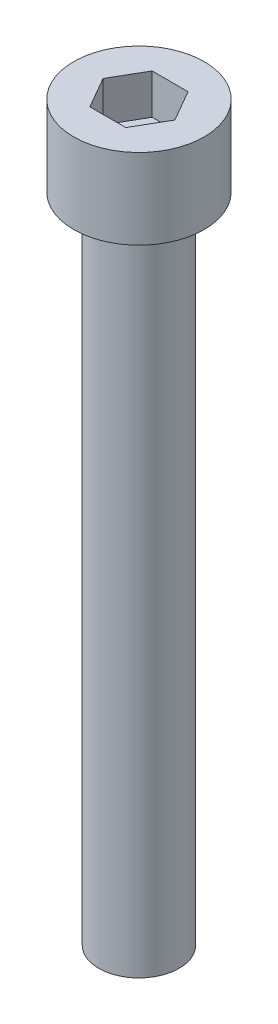
ISO-10303-21;
HEADER;
FILE_DESCRIPTION(('STEP AP214'),'2;1');
FILE_NAME('part.step','',(''),(''),'','','');
FILE_SCHEMA(('AUTOMOTIVE_DESIGN { 1 0 10303 214 1 1 1 1 }'));
ENDSEC;
DATA;
#1=APPLICATION_CONTEXT('core data for automotive mechanical design processes');
#2=APPLICATION_PROTOCOL_DEFINITION('international standard','automotive_design',2000,#1);
#3=PRODUCT_CONTEXT('',#1,'mechanical');
#4=PRODUCT('Part','Part','',(#3));
#5=PRODUCT_RELATED_PRODUCT_CATEGORY('part','',(#4));
#6=PRODUCT_DEFINITION_FORMATION('','',#4);
#7=PRODUCT_DEFINITION_CONTEXT('part definition',#1,'design');
#8=PRODUCT_DEFINITION('design','',#6,#7);
#9=PRODUCT_DEFINITION_SHAPE('','',#8);
#10=(LENGTH_UNIT() NAMED_UNIT(*) SI_UNIT(.MILLI.,.METRE.));
#11=(NAMED_UNIT(*) PLANE_ANGLE_UNIT() SI_UNIT($,.RADIAN.));
#12=(NAMED_UNIT(*) SI_UNIT($,.STERADIAN.) SOLID_ANGLE_UNIT());
#13=UNCERTAINTY_MEASURE_WITH_UNIT(LENGTH_MEASURE(1.E-05),#10,'distance_accuracy_value','');
#14=(GEOMETRIC_REPRESENTATION_CONTEXT(3) GLOBAL_UNCERTAINTY_ASSIGNED_CONTEXT((#13)) GLOBAL_UNIT_ASSIGNED_CONTEXT((#10,
#11,#12)) REPRESENTATION_CONTEXT('',''));
#15=CARTESIAN_POINT('',(0.,0.,0.));
#16=DIRECTION('',(0.,0.,1.));
#17=DIRECTION('',(1.,0.,0.));
#18=AXIS2_PLACEMENT_3D('',#15,#16,#17);
#19=CARTESIAN_POINT('',(0.,8.,0.));
#20=DIRECTION('',(0.,-1.,0.));
#21=DIRECTION('',(0.,0.,-1.));
#22=AXIS2_PLACEMENT_3D('',#19,#20,#21);
#23=CYLINDRICAL_SURFACE('',#22,6.5);
#24=CARTESIAN_POINT('',(0.,8.,0.));
#25=DIRECTION('',(0.,1.,0.));
#26=DIRECTION('',(0.,0.,1.));
#27=AXIS2_PLACEMENT_3D('',#24,#25,#26);
#28=CIRCLE('',#27,6.5);
#29=CARTESIAN_POINT('',(0.,8.,6.5));
#30=VERTEX_POINT('',#29);
#31=EDGE_CURVE('E45',#30,#30,#28,.T.);
#32=ORIENTED_EDGE('',*,*,#31,.F.);
#33=EDGE_LOOP('',(#32));
#34=FACE_BOUND('',#33,.T.);
#35=CARTESIAN_POINT('',(0.,0.,0.));
#36=DIRECTION('',(0.,1.,0.));
#37=DIRECTION('',(0.,0.,1.));
#38=AXIS2_PLACEMENT_3D('',#35,#36,#37);
#39=CIRCLE('',#38,6.5);
#40=CARTESIAN_POINT('',(0.,0.,6.5));
#41=VERTEX_POINT('',#40);
#42=EDGE_CURVE('E40',#41,#41,#39,.T.);
#43=ORIENTED_EDGE('',*,*,#42,.T.);
#44=EDGE_LOOP('',(#43));
#45=FACE_BOUND('',#44,.T.);
#46=ADVANCED_FACE('F37',(#34,#45),#23,.T.);
#47=CARTESIAN_POINT('',(0.,8.,0.));
#48=DIRECTION('',(0.,1.,0.));
#49=DIRECTION('',(0.,0.,1.));
#50=AXIS2_PLACEMENT_3D('',#47,#48,#49);
#51=PLANE('',#50);
#52=DIRECTION('',(0.5,0.,-0.866025403784439));
#53=VECTOR('',#52,1.);
#54=CARTESIAN_POINT('',(1.78978583448784,8.,3.1));
#55=LINE('',#54,#53);
#56=CARTESIAN_POINT('',(1.78978583448784,8.,3.1));
#57=VERTEX_POINT('',#56);
#58=CARTESIAN_POINT('',(3.57957166897568,8.,0.));
#59=VERTEX_POINT('',#58);
#60=EDGE_CURVE('E53',#57,#59,#55,.T.);
#61=ORIENTED_EDGE('',*,*,#60,.F.);
#62=DIRECTION('',(1.,0.,0.));
#63=VECTOR('',#62,1.);
#64=CARTESIAN_POINT('',(-1.78978583448784,8.,3.1));
#65=LINE('',#64,#63);
#66=CARTESIAN_POINT('',(-1.78978583448784,8.,3.1));
#67=VERTEX_POINT('',#66);
#68=EDGE_CURVE('E137',#67,#57,#65,.T.);
#69=ORIENTED_EDGE('',*,*,#68,.F.);
#70=DIRECTION('',(0.5,0.,0.866025403784439));
#71=VECTOR('',#70,1.);
#72=CARTESIAN_POINT('',(-3.57957166897568,8.,0.));
#73=LINE('',#72,#71);
#74=CARTESIAN_POINT('',(-3.57957166897568,8.,0.));
#75=VERTEX_POINT('',#74);
#76=EDGE_CURVE('E135',#75,#67,#73,.T.);
#77=ORIENTED_EDGE('',*,*,#76,.F.);
#78=DIRECTION('',(-0.5,0.,0.866025403784439));
#79=VECTOR('',#78,1.);
#80=CARTESIAN_POINT('',(-1.78978583448784,8.,-3.1));
#81=LINE('',#80,#79);
#82=CARTESIAN_POINT('',(-1.78978583448784,8.,-3.1));
#83=VERTEX_POINT('',#82);
#84=EDGE_CURVE('E101',#83,#75,#81,.T.);
#85=ORIENTED_EDGE('',*,*,#84,.F.);
#86=DIRECTION('',(-1.,0.,0.));
#87=VECTOR('',#86,1.);
#88=CARTESIAN_POINT('',(1.78978583448784,8.,-3.1));
#89=LINE('',#88,#87);
#90=CARTESIAN_POINT('',(1.78978583448784,8.,-3.1));
#91=VERTEX_POINT('',#90);
#92=EDGE_CURVE('E131',#91,#83,#89,.T.);
#93=ORIENTED_EDGE('',*,*,#92,.F.);
#94=DIRECTION('',(-0.5,0.,-0.866025403784439));
#95=VECTOR('',#94,1.);
#96=CARTESIAN_POINT('',(3.57957166897568,8.,0.));
#97=LINE('',#96,#95);
#98=EDGE_CURVE('E127',#59,#91,#97,.T.);
#99=ORIENTED_EDGE('',*,*,#98,.F.);
#100=EDGE_LOOP('',(#61,#69,#77,#85,#93,#99));
#101=FACE_BOUND('',#100,.T.);
#102=ORIENTED_EDGE('',*,*,#31,.T.);
#103=EDGE_LOOP('',(#102));
#104=FACE_BOUND('',#103,.T.);
#105=ADVANCED_FACE('F155',(#101,#104),#51,.T.);
#106=CARTESIAN_POINT('',(0.,0.,0.));
#107=DIRECTION('',(0.,1.,0.));
#108=DIRECTION('',(0.,0.,1.));
#109=AXIS2_PLACEMENT_3D('',#106,#107,#108);
#110=PLANE('',#109);
#111=CARTESIAN_POINT('',(0.,0.,0.));
#112=DIRECTION('',(0.,-1.,0.));
#113=DIRECTION('',(0.,0.,-1.));
#114=AXIS2_PLACEMENT_3D('',#111,#112,#113);
#115=CIRCLE('',#114,4.);
#116=CARTESIAN_POINT('',(0.,0.,-4.));
#117=VERTEX_POINT('',#116);
#118=EDGE_CURVE('E11',#117,#117,#115,.T.);
#119=ORIENTED_EDGE('',*,*,#118,.F.);
#120=EDGE_LOOP('',(#119));
#121=FACE_BOUND('',#120,.T.);
#122=ORIENTED_EDGE('',*,*,#42,.F.);
#123=EDGE_LOOP('',(#122));
#124=FACE_BOUND('',#123,.T.);
#125=ADVANCED_FACE('F152',(#121,#124),#110,.F.);
#126=CARTESIAN_POINT('',(1.78978583448784,4.,3.1));
#127=DIRECTION('',(0.866025403784439,0.,0.5));
#128=DIRECTION('',(0.5,0.,-0.866025403784439));
#129=AXIS2_PLACEMENT_3D('',#126,#127,#128);
#130=PLANE('',#129);
#131=ORIENTED_EDGE('',*,*,#60,.T.);
#132=DIRECTION('',(0.,1.,0.));
#133=VECTOR('',#132,1.);
#134=CARTESIAN_POINT('',(3.57957166897568,4.,0.));
#135=LINE('',#134,#133);
#136=CARTESIAN_POINT('',(3.57957166897568,4.,0.));
#137=VERTEX_POINT('',#136);
#138=EDGE_CURVE('E83',#137,#59,#135,.T.);
#139=ORIENTED_EDGE('',*,*,#138,.F.);
#140=DIRECTION('',(0.5,0.,-0.866025403784439));
#141=VECTOR('',#140,1.);
#142=CARTESIAN_POINT('',(1.78978583448784,4.,3.1));
#143=LINE('',#142,#141);
#144=CARTESIAN_POINT('',(1.78978583448784,4.,3.1));
#145=VERTEX_POINT('',#144);
#146=EDGE_CURVE('E139',#145,#137,#143,.T.);
#147=ORIENTED_EDGE('',*,*,#146,.F.);
#148=DIRECTION('',(0.,1.,0.));
#149=VECTOR('',#148,1.);
#150=CARTESIAN_POINT('',(1.78978583448784,4.,3.1));
#151=LINE('',#150,#149);
#152=EDGE_CURVE('E61',#145,#57,#151,.T.);
#153=ORIENTED_EDGE('',*,*,#152,.T.);
#154=EDGE_LOOP('',(#131,#139,#147,#153));
#155=FACE_BOUND('',#154,.T.);
#156=ADVANCED_FACE('F154',(#155),#130,.F.);
#157=CARTESIAN_POINT('',(-1.78978583448784,4.,3.1));
#158=DIRECTION('',(0.,0.,1.));
#159=DIRECTION('',(1.,0.,0.));
#160=AXIS2_PLACEMENT_3D('',#157,#158,#159);
#161=PLANE('',#160);
#162=ORIENTED_EDGE('',*,*,#68,.T.);
#163=ORIENTED_EDGE('',*,*,#152,.F.);
#164=DIRECTION('',(1.,0.,0.));
#165=VECTOR('',#164,1.);
#166=CARTESIAN_POINT('',(-1.78978583448784,4.,3.1));
#167=LINE('',#166,#165);
#168=CARTESIAN_POINT('',(-1.78978583448784,4.,3.1));
#169=VERTEX_POINT('',#168);
#170=EDGE_CURVE('E113',#169,#145,#167,.T.);
#171=ORIENTED_EDGE('',*,*,#170,.F.);
#172=DIRECTION('',(0.,1.,0.));
#173=VECTOR('',#172,1.);
#174=CARTESIAN_POINT('',(-1.78978583448784,4.,3.1));
#175=LINE('',#174,#173);
#176=EDGE_CURVE('E105',#169,#67,#175,.T.);
#177=ORIENTED_EDGE('',*,*,#176,.T.);
#178=EDGE_LOOP('',(#162,#163,#171,#177));
#179=FACE_BOUND('',#178,.T.);
#180=ADVANCED_FACE('F161',(#179),#161,.F.);
#181=CARTESIAN_POINT('',(-3.57957166897568,4.,0.));
#182=DIRECTION('',(-0.866025403784439,0.,0.5));
#183=DIRECTION('',(0.5,0.,0.866025403784439));
#184=AXIS2_PLACEMENT_3D('',#181,#182,#183);
#185=PLANE('',#184);
#186=ORIENTED_EDGE('',*,*,#76,.T.);
#187=ORIENTED_EDGE('',*,*,#176,.F.);
#188=DIRECTION('',(0.5,0.,0.866025403784439));
#189=VECTOR('',#188,1.);
#190=CARTESIAN_POINT('',(-3.57957166897568,4.,0.));
#191=LINE('',#190,#189);
#192=CARTESIAN_POINT('',(-3.57957166897568,4.,0.));
#193=VERTEX_POINT('',#192);
#194=EDGE_CURVE('E109',#193,#169,#191,.T.);
#195=ORIENTED_EDGE('',*,*,#194,.F.);
#196=DIRECTION('',(0.,1.,0.));
#197=VECTOR('',#196,1.);
#198=CARTESIAN_POINT('',(-3.57957166897568,4.,0.));
#199=LINE('',#198,#197);
#200=EDGE_CURVE('E94',#193,#75,#199,.T.);
#201=ORIENTED_EDGE('',*,*,#200,.T.);
#202=EDGE_LOOP('',(#186,#187,#195,#201));
#203=FACE_BOUND('',#202,.T.);
#204=ADVANCED_FACE('F110',(#203),#185,.F.);
#205=CARTESIAN_POINT('',(-1.78978583448784,4.,-3.1));
#206=DIRECTION('',(-0.866025403784439,0.,-0.5));
#207=DIRECTION('',(-0.5,0.,0.866025403784439));
#208=AXIS2_PLACEMENT_3D('',#205,#206,#207);
#209=PLANE('',#208);
#210=ORIENTED_EDGE('',*,*,#84,.T.);
#211=ORIENTED_EDGE('',*,*,#200,.F.);
#212=DIRECTION('',(-0.5,0.,0.866025403784439));
#213=VECTOR('',#212,1.);
#214=CARTESIAN_POINT('',(-1.78978583448784,4.,-3.1));
#215=LINE('',#214,#213);
#216=CARTESIAN_POINT('',(-1.78978583448784,4.,-3.1));
#217=VERTEX_POINT('',#216);
#218=EDGE_CURVE('E98',#217,#193,#215,.T.);
#219=ORIENTED_EDGE('',*,*,#218,.F.);
#220=DIRECTION('',(0.,1.,0.));
#221=VECTOR('',#220,1.);
#222=CARTESIAN_POINT('',(-1.78978583448784,4.,-3.1));
#223=LINE('',#222,#221);
#224=EDGE_CURVE('E106',#217,#83,#223,.T.);
#225=ORIENTED_EDGE('',*,*,#224,.T.);
#226=EDGE_LOOP('',(#210,#211,#219,#225));
#227=FACE_BOUND('',#226,.T.);
#228=ADVANCED_FACE('F96',(#227),#209,.F.);
#229=CARTESIAN_POINT('',(1.78978583448784,4.,-3.1));
#230=DIRECTION('',(0.,0.,-1.));
#231=DIRECTION('',(-1.,0.,0.));
#232=AXIS2_PLACEMENT_3D('',#229,#230,#231);
#233=PLANE('',#232);
#234=ORIENTED_EDGE('',*,*,#92,.T.);
#235=ORIENTED_EDGE('',*,*,#224,.F.);
#236=DIRECTION('',(-1.,0.,0.));
#237=VECTOR('',#236,1.);
#238=CARTESIAN_POINT('',(1.78978583448784,4.,-3.1));
#239=LINE('',#238,#237);
#240=CARTESIAN_POINT('',(1.78978583448784,4.,-3.1));
#241=VERTEX_POINT('',#240);
#242=EDGE_CURVE('E119',#241,#217,#239,.T.);
#243=ORIENTED_EDGE('',*,*,#242,.F.);
#244=DIRECTION('',(0.,1.,0.));
#245=VECTOR('',#244,1.);
#246=CARTESIAN_POINT('',(1.78978583448784,4.,-3.1));
#247=LINE('',#246,#245);
#248=EDGE_CURVE('E143',#241,#91,#247,.T.);
#249=ORIENTED_EDGE('',*,*,#248,.T.);
#250=EDGE_LOOP('',(#234,#235,#243,#249));
#251=FACE_BOUND('',#250,.T.);
#252=ADVANCED_FACE('F206',(#251),#233,.F.);
#253=CARTESIAN_POINT('',(3.57957166897568,4.,0.));
#254=DIRECTION('',(0.866025403784439,0.,-0.5));
#255=DIRECTION('',(-0.5,0.,-0.866025403784439));
#256=AXIS2_PLACEMENT_3D('',#253,#254,#255);
#257=PLANE('',#256);
#258=ORIENTED_EDGE('',*,*,#98,.T.);
#259=ORIENTED_EDGE('',*,*,#248,.F.);
#260=DIRECTION('',(-0.5,0.,-0.866025403784439));
#261=VECTOR('',#260,1.);
#262=CARTESIAN_POINT('',(3.57957166897568,4.,0.));
#263=LINE('',#262,#261);
#264=EDGE_CURVE('E121',#137,#241,#263,.T.);
#265=ORIENTED_EDGE('',*,*,#264,.F.);
#266=ORIENTED_EDGE('',*,*,#138,.T.);
#267=EDGE_LOOP('',(#258,#259,#265,#266));
#268=FACE_BOUND('',#267,.T.);
#269=ADVANCED_FACE('F215',(#268),#257,.F.);
#270=CARTESIAN_POINT('',(0.,4.,0.));
#271=DIRECTION('',(0.,1.,0.));
#272=DIRECTION('',(0.,0.,1.));
#273=AXIS2_PLACEMENT_3D('',#270,#271,#272);
#274=PLANE('',#273);
#275=ORIENTED_EDGE('',*,*,#146,.T.);
#276=ORIENTED_EDGE('',*,*,#264,.T.);
#277=ORIENTED_EDGE('',*,*,#242,.T.);
#278=ORIENTED_EDGE('',*,*,#218,.T.);
#279=ORIENTED_EDGE('',*,*,#194,.T.);
#280=ORIENTED_EDGE('',*,*,#170,.T.);
#281=EDGE_LOOP('',(#275,#276,#277,#278,#279,#280));
#282=FACE_BOUND('',#281,.T.);
#283=ADVANCED_FACE('F116',(#282),#274,.T.);
#284=CARTESIAN_POINT('',(0.,-65.,0.));
#285=DIRECTION('',(0.,1.,0.));
#286=DIRECTION('',(0.,0.,1.));
#287=AXIS2_PLACEMENT_3D('',#284,#285,#286);
#288=CYLINDRICAL_SURFACE('',#287,4.);
#289=CARTESIAN_POINT('',(0.,-65.,0.));
#290=DIRECTION('',(0.,-1.,0.));
#291=DIRECTION('',(0.,0.,-1.));
#292=AXIS2_PLACEMENT_3D('',#289,#290,#291);
#293=CIRCLE('',#292,4.);
#294=CARTESIAN_POINT('',(0.,-65.,-4.));
#295=VERTEX_POINT('',#294);
#296=EDGE_CURVE('E128',#295,#295,#293,.T.);
#297=ORIENTED_EDGE('',*,*,#296,.F.);
#298=EDGE_LOOP('',(#297));
#299=FACE_BOUND('',#298,.T.);
#300=ORIENTED_EDGE('',*,*,#118,.T.);
#301=EDGE_LOOP('',(#300));
#302=FACE_BOUND('',#301,.T.);
#303=ADVANCED_FACE('F233',(#299,#302),#288,.T.);
#304=CARTESIAN_POINT('',(0.,-65.,0.));
#305=DIRECTION('',(0.,-1.,0.));
#306=DIRECTION('',(0.,0.,-1.));
#307=AXIS2_PLACEMENT_3D('',#304,#305,#306);
#308=PLANE('',#307);
#309=ORIENTED_EDGE('',*,*,#296,.T.);
#310=EDGE_LOOP('',(#309));
#311=FACE_BOUND('',#310,.T.);
#312=ADVANCED_FACE('F247',(#311),#308,.T.);
#313=CLOSED_SHELL('',(#46,#105,#125,#156,#180,#204,#228,#252,#269,#283,#303,#312));
#314=MANIFOLD_SOLID_BREP('B2',#313);
#315=ADVANCED_BREP_SHAPE_REPRESENTATION('',(#18,#314),#14);
#316=SHAPE_DEFINITION_REPRESENTATION(#9,#315);
ENDSEC;
END-ISO-10303-21;
